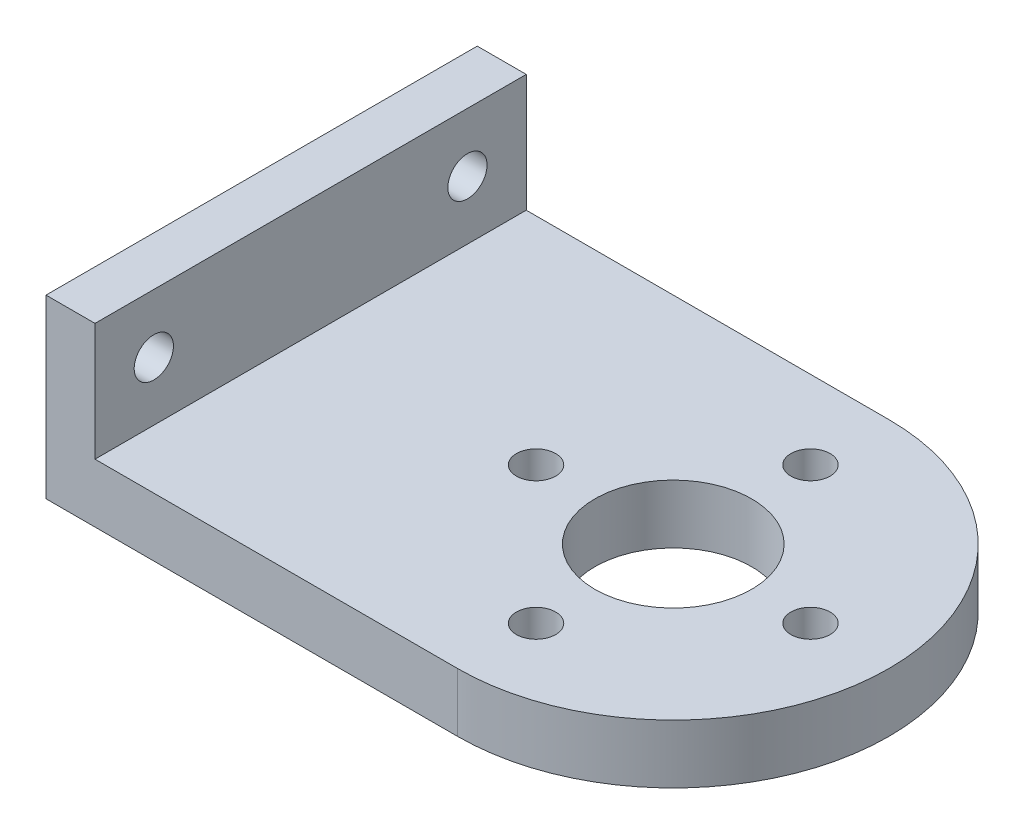
ISO-10303-21;
HEADER;
FILE_DESCRIPTION(('STEP AP214'),'2;1');
FILE_NAME('part.step','',(''),(''),'','','');
FILE_SCHEMA(('AUTOMOTIVE_DESIGN { 1 0 10303 214 1 1 1 1 }'));
ENDSEC;
DATA;
#1=APPLICATION_CONTEXT('core data for automotive mechanical design processes');
#2=APPLICATION_PROTOCOL_DEFINITION('international standard','automotive_design',2000,#1);
#3=PRODUCT_CONTEXT('',#1,'mechanical');
#4=PRODUCT('Part','Part','',(#3));
#5=PRODUCT_RELATED_PRODUCT_CATEGORY('part','',(#4));
#6=PRODUCT_DEFINITION_FORMATION('','',#4);
#7=PRODUCT_DEFINITION_CONTEXT('part definition',#1,'design');
#8=PRODUCT_DEFINITION('design','',#6,#7);
#9=PRODUCT_DEFINITION_SHAPE('','',#8);
#10=(LENGTH_UNIT() NAMED_UNIT(*) SI_UNIT(.MILLI.,.METRE.));
#11=(NAMED_UNIT(*) PLANE_ANGLE_UNIT() SI_UNIT($,.RADIAN.));
#12=(NAMED_UNIT(*) SI_UNIT($,.STERADIAN.) SOLID_ANGLE_UNIT());
#13=UNCERTAINTY_MEASURE_WITH_UNIT(LENGTH_MEASURE(1.E-05),#10,'distance_accuracy_value','');
#14=(GEOMETRIC_REPRESENTATION_CONTEXT(3) GLOBAL_UNCERTAINTY_ASSIGNED_CONTEXT((#13)) GLOBAL_UNIT_ASSIGNED_CONTEXT((#10,
#11,#12)) REPRESENTATION_CONTEXT('',''));
#15=CARTESIAN_POINT('',(0.,0.,0.));
#16=DIRECTION('',(0.,0.,1.));
#17=DIRECTION('',(1.,0.,0.));
#18=AXIS2_PLACEMENT_3D('',#15,#16,#17);
#19=CARTESIAN_POINT('',(-14.,3.,0.));
#20=DIRECTION('',(-1.,0.,0.));
#21=DIRECTION('',(0.,0.,1.));
#22=AXIS2_PLACEMENT_3D('',#19,#20,#21);
#23=PLANE('',#22);
#24=CARTESIAN_POINT('',(-14.,6.,8.));
#25=DIRECTION('',(-1.,0.,0.));
#26=DIRECTION('',(0.,0.,1.));
#27=AXIS2_PLACEMENT_3D('',#24,#25,#26);
#28=CIRCLE('',#27,1.);
#29=CARTESIAN_POINT('',(-14.,6.,9.));
#30=VERTEX_POINT('',#29);
#31=EDGE_CURVE('E169',#30,#30,#28,.T.);
#32=ORIENTED_EDGE('',*,*,#31,.F.);
#33=EDGE_LOOP('',(#32));
#34=FACE_BOUND('',#33,.T.);
#35=CARTESIAN_POINT('',(-14.,6.,-8.));
#36=DIRECTION('',(-1.,0.,0.));
#37=DIRECTION('',(0.,0.,1.));
#38=AXIS2_PLACEMENT_3D('',#35,#36,#37);
#39=CIRCLE('',#38,1.);
#40=CARTESIAN_POINT('',(-14.,6.,-7.));
#41=VERTEX_POINT('',#40);
#42=EDGE_CURVE('E155',#41,#41,#39,.T.);
#43=ORIENTED_EDGE('',*,*,#42,.F.);
#44=EDGE_LOOP('',(#43));
#45=FACE_BOUND('',#44,.T.);
#46=DIRECTION('',(0.,0.,-1.));
#47=VECTOR('',#46,1.);
#48=CARTESIAN_POINT('',(-14.,0.,0.));
#49=LINE('',#48,#47);
#50=CARTESIAN_POINT('',(-14.,0.,11.));
#51=VERTEX_POINT('',#50);
#52=CARTESIAN_POINT('',(-14.,0.,-11.));
#53=VERTEX_POINT('',#52);
#54=EDGE_CURVE('E80',#51,#53,#49,.T.);
#55=ORIENTED_EDGE('',*,*,#54,.F.);
#56=DIRECTION('',(0.,-1.,0.));
#57=VECTOR('',#56,1.);
#58=CARTESIAN_POINT('',(-14.,3.,11.));
#59=LINE('',#58,#57);
#60=CARTESIAN_POINT('',(-14.,9.,11.));
#61=VERTEX_POINT('',#60);
#62=EDGE_CURVE('E11',#61,#51,#59,.T.);
#63=ORIENTED_EDGE('',*,*,#62,.F.);
#64=DIRECTION('',(0.,0.,1.));
#65=VECTOR('',#64,1.);
#66=CARTESIAN_POINT('',(-14.,9.,11.));
#67=LINE('',#66,#65);
#68=CARTESIAN_POINT('',(-14.,9.,-11.));
#69=VERTEX_POINT('',#68);
#70=EDGE_CURVE('E83',#69,#61,#67,.T.);
#71=ORIENTED_EDGE('',*,*,#70,.F.);
#72=DIRECTION('',(0.,-1.,0.));
#73=VECTOR('',#72,1.);
#74=CARTESIAN_POINT('',(-14.,3.,-11.));
#75=LINE('',#74,#73);
#76=EDGE_CURVE('E77',#69,#53,#75,.T.);
#77=ORIENTED_EDGE('',*,*,#76,.T.);
#78=EDGE_LOOP('',(#55,#63,#71,#77));
#79=FACE_BOUND('',#78,.T.);
#80=ADVANCED_FACE('F35',(#34,#45,#79),#23,.T.);
#81=CARTESIAN_POINT('',(0.,3.,11.));
#82=DIRECTION('',(0.,0.,1.));
#83=DIRECTION('',(1.,0.,0.));
#84=AXIS2_PLACEMENT_3D('',#81,#82,#83);
#85=PLANE('',#84);
#86=DIRECTION('',(-1.,0.,0.));
#87=VECTOR('',#86,1.);
#88=CARTESIAN_POINT('',(0.,0.,11.));
#89=LINE('',#88,#87);
#90=CARTESIAN_POINT('',(7.,0.,11.));
#91=VERTEX_POINT('',#90);
#92=EDGE_CURVE('E97',#91,#51,#89,.T.);
#93=ORIENTED_EDGE('',*,*,#92,.F.);
#94=DIRECTION('',(0.,-1.,0.));
#95=VECTOR('',#94,1.);
#96=CARTESIAN_POINT('',(7.,3.,11.));
#97=LINE('',#96,#95);
#98=CARTESIAN_POINT('',(7.,3.,11.));
#99=VERTEX_POINT('',#98);
#100=EDGE_CURVE('E43',#99,#91,#97,.T.);
#101=ORIENTED_EDGE('',*,*,#100,.F.);
#102=DIRECTION('',(-1.,0.,0.));
#103=VECTOR('',#102,1.);
#104=CARTESIAN_POINT('',(0.,3.,11.));
#105=LINE('',#104,#103);
#106=CARTESIAN_POINT('',(-11.5,3.,11.));
#107=VERTEX_POINT('',#106);
#108=EDGE_CURVE('E136',#99,#107,#105,.T.);
#109=ORIENTED_EDGE('',*,*,#108,.T.);
#110=DIRECTION('',(0.,-1.,0.));
#111=VECTOR('',#110,1.);
#112=CARTESIAN_POINT('',(-11.5,9.,11.));
#113=LINE('',#112,#111);
#114=CARTESIAN_POINT('',(-11.5,9.,11.));
#115=VERTEX_POINT('',#114);
#116=EDGE_CURVE('E131',#115,#107,#113,.T.);
#117=ORIENTED_EDGE('',*,*,#116,.F.);
#118=DIRECTION('',(1.,0.,0.));
#119=VECTOR('',#118,1.);
#120=CARTESIAN_POINT('',(-11.5,9.,11.));
#121=LINE('',#120,#119);
#122=EDGE_CURVE('E160',#61,#115,#121,.T.);
#123=ORIENTED_EDGE('',*,*,#122,.F.);
#124=ORIENTED_EDGE('',*,*,#62,.T.);
#125=EDGE_LOOP('',(#93,#101,#109,#117,#123,#124));
#126=FACE_BOUND('',#125,.T.);
#127=ADVANCED_FACE('F117',(#126),#85,.T.);
#128=CARTESIAN_POINT('',(7.,3.,0.));
#129=DIRECTION('',(0.,-1.,0.));
#130=DIRECTION('',(0.,0.,-1.));
#131=AXIS2_PLACEMENT_3D('',#128,#129,#130);
#132=CYLINDRICAL_SURFACE('',#131,11.);
#133=CARTESIAN_POINT('',(7.,0.,0.));
#134=DIRECTION('',(0.,1.,0.));
#135=DIRECTION('',(0.,0.,1.));
#136=AXIS2_PLACEMENT_3D('',#133,#134,#135);
#137=CIRCLE('',#136,11.);
#138=CARTESIAN_POINT('',(7.,0.,-11.));
#139=VERTEX_POINT('',#138);
#140=EDGE_CURVE('E104',#91,#139,#137,.T.);
#141=ORIENTED_EDGE('',*,*,#140,.T.);
#142=DIRECTION('',(0.,-1.,0.));
#143=VECTOR('',#142,1.);
#144=CARTESIAN_POINT('',(7.,3.,-11.));
#145=LINE('',#144,#143);
#146=CARTESIAN_POINT('',(7.,3.,-11.));
#147=VERTEX_POINT('',#146);
#148=EDGE_CURVE('E87',#147,#139,#145,.T.);
#149=ORIENTED_EDGE('',*,*,#148,.F.);
#150=CARTESIAN_POINT('',(7.,3.,0.));
#151=DIRECTION('',(0.,1.,0.));
#152=DIRECTION('',(0.,0.,1.));
#153=AXIS2_PLACEMENT_3D('',#150,#151,#152);
#154=CIRCLE('',#153,11.);
#155=EDGE_CURVE('E115',#99,#147,#154,.T.);
#156=ORIENTED_EDGE('',*,*,#155,.F.);
#157=ORIENTED_EDGE('',*,*,#100,.T.);
#158=EDGE_LOOP('',(#141,#149,#156,#157));
#159=FACE_BOUND('',#158,.T.);
#160=ADVANCED_FACE('F114',(#159),#132,.T.);
#161=CARTESIAN_POINT('',(0.,3.,-11.));
#162=DIRECTION('',(0.,0.,-1.));
#163=DIRECTION('',(-1.,0.,0.));
#164=AXIS2_PLACEMENT_3D('',#161,#162,#163);
#165=PLANE('',#164);
#166=DIRECTION('',(1.,0.,0.));
#167=VECTOR('',#166,1.);
#168=CARTESIAN_POINT('',(0.,0.,-11.));
#169=LINE('',#168,#167);
#170=EDGE_CURVE('E95',#53,#139,#169,.T.);
#171=ORIENTED_EDGE('',*,*,#170,.F.);
#172=ORIENTED_EDGE('',*,*,#76,.F.);
#173=DIRECTION('',(-1.,0.,0.));
#174=VECTOR('',#173,1.);
#175=CARTESIAN_POINT('',(-14.,9.,-11.));
#176=LINE('',#175,#174);
#177=CARTESIAN_POINT('',(-11.5,9.,-11.));
#178=VERTEX_POINT('',#177);
#179=EDGE_CURVE('E153',#178,#69,#176,.T.);
#180=ORIENTED_EDGE('',*,*,#179,.F.);
#181=DIRECTION('',(0.,-1.,0.));
#182=VECTOR('',#181,1.);
#183=CARTESIAN_POINT('',(-11.5,9.,-11.));
#184=LINE('',#183,#182);
#185=CARTESIAN_POINT('',(-11.5,3.,-11.));
#186=VERTEX_POINT('',#185);
#187=EDGE_CURVE('E151',#178,#186,#184,.T.);
#188=ORIENTED_EDGE('',*,*,#187,.T.);
#189=DIRECTION('',(1.,0.,0.));
#190=VECTOR('',#189,1.);
#191=CARTESIAN_POINT('',(0.,3.,-11.));
#192=LINE('',#191,#190);
#193=EDGE_CURVE('E58',#186,#147,#192,.T.);
#194=ORIENTED_EDGE('',*,*,#193,.T.);
#195=ORIENTED_EDGE('',*,*,#148,.T.);
#196=EDGE_LOOP('',(#171,#172,#180,#188,#194,#195));
#197=FACE_BOUND('',#196,.T.);
#198=ADVANCED_FACE('F100',(#197),#165,.T.);
#199=CARTESIAN_POINT('',(7.00000000000007,3.,-7.));
#200=DIRECTION('',(0.,-1.,0.));
#201=DIRECTION('',(0.,0.,-1.));
#202=AXIS2_PLACEMENT_3D('',#199,#200,#201);
#203=CYLINDRICAL_SURFACE('',#202,1.);
#204=CARTESIAN_POINT('',(7.00000000000007,3.,-7.));
#205=DIRECTION('',(0.,1.,0.));
#206=DIRECTION('',(0.,0.,1.));
#207=AXIS2_PLACEMENT_3D('',#204,#205,#206);
#208=CIRCLE('',#207,1.);
#209=CARTESIAN_POINT('',(7.00000000000007,3.,-6.));
#210=VERTEX_POINT('',#209);
#211=EDGE_CURVE('E138',#210,#210,#208,.T.);
#212=ORIENTED_EDGE('',*,*,#211,.T.);
#213=EDGE_LOOP('',(#212));
#214=FACE_BOUND('',#213,.T.);
#215=CARTESIAN_POINT('',(7.00000000000007,0.,-7.));
#216=DIRECTION('',(0.,1.,0.));
#217=DIRECTION('',(0.,0.,1.));
#218=AXIS2_PLACEMENT_3D('',#215,#216,#217);
#219=CIRCLE('',#218,1.);
#220=CARTESIAN_POINT('',(7.00000000000007,0.,-6.));
#221=VERTEX_POINT('',#220);
#222=EDGE_CURVE('E98',#221,#221,#219,.T.);
#223=ORIENTED_EDGE('',*,*,#222,.F.);
#224=EDGE_LOOP('',(#223));
#225=FACE_BOUND('',#224,.T.);
#226=ADVANCED_FACE('F233',(#214,#225),#203,.F.);
#227=CARTESIAN_POINT('',(14.,3.,0.));
#228=DIRECTION('',(0.,-1.,0.));
#229=DIRECTION('',(0.,0.,-1.));
#230=AXIS2_PLACEMENT_3D('',#227,#228,#229);
#231=CYLINDRICAL_SURFACE('',#230,1.);
#232=CARTESIAN_POINT('',(14.,3.,0.));
#233=DIRECTION('',(0.,1.,0.));
#234=DIRECTION('',(0.,0.,1.));
#235=AXIS2_PLACEMENT_3D('',#232,#233,#234);
#236=CIRCLE('',#235,1.);
#237=CARTESIAN_POINT('',(14.,3.,1.));
#238=VERTEX_POINT('',#237);
#239=EDGE_CURVE('E141',#238,#238,#236,.T.);
#240=ORIENTED_EDGE('',*,*,#239,.T.);
#241=EDGE_LOOP('',(#240));
#242=FACE_BOUND('',#241,.T.);
#243=CARTESIAN_POINT('',(14.,0.,0.));
#244=DIRECTION('',(0.,1.,0.));
#245=DIRECTION('',(0.,0.,1.));
#246=AXIS2_PLACEMENT_3D('',#243,#244,#245);
#247=CIRCLE('',#246,1.);
#248=CARTESIAN_POINT('',(14.,0.,1.));
#249=VERTEX_POINT('',#248);
#250=EDGE_CURVE('E122',#249,#249,#247,.T.);
#251=ORIENTED_EDGE('',*,*,#250,.F.);
#252=EDGE_LOOP('',(#251));
#253=FACE_BOUND('',#252,.T.);
#254=ADVANCED_FACE('F236',(#242,#253),#231,.F.);
#255=CARTESIAN_POINT('',(7.,3.,0.));
#256=DIRECTION('',(0.,-1.,0.));
#257=DIRECTION('',(0.,0.,-1.));
#258=AXIS2_PLACEMENT_3D('',#255,#256,#257);
#259=CYLINDRICAL_SURFACE('',#258,4.);
#260=CARTESIAN_POINT('',(7.,3.,0.));
#261=DIRECTION('',(0.,1.,0.));
#262=DIRECTION('',(0.,0.,1.));
#263=AXIS2_PLACEMENT_3D('',#260,#261,#262);
#264=CIRCLE('',#263,4.);
#265=CARTESIAN_POINT('',(7.,3.,4.));
#266=VERTEX_POINT('',#265);
#267=EDGE_CURVE('E144',#266,#266,#264,.T.);
#268=ORIENTED_EDGE('',*,*,#267,.T.);
#269=EDGE_LOOP('',(#268));
#270=FACE_BOUND('',#269,.T.);
#271=CARTESIAN_POINT('',(7.,0.,0.));
#272=DIRECTION('',(0.,1.,0.));
#273=DIRECTION('',(0.,0.,1.));
#274=AXIS2_PLACEMENT_3D('',#271,#272,#273);
#275=CIRCLE('',#274,4.);
#276=CARTESIAN_POINT('',(7.,0.,4.));
#277=VERTEX_POINT('',#276);
#278=EDGE_CURVE('E125',#277,#277,#275,.T.);
#279=ORIENTED_EDGE('',*,*,#278,.F.);
#280=EDGE_LOOP('',(#279));
#281=FACE_BOUND('',#280,.T.);
#282=ADVANCED_FACE('F239',(#270,#281),#259,.F.);
#283=CARTESIAN_POINT('',(0.,3.,0.));
#284=DIRECTION('',(0.,-1.,0.));
#285=DIRECTION('',(0.,0.,-1.));
#286=AXIS2_PLACEMENT_3D('',#283,#284,#285);
#287=CYLINDRICAL_SURFACE('',#286,1.);
#288=CARTESIAN_POINT('',(0.,3.,0.));
#289=DIRECTION('',(0.,1.,0.));
#290=DIRECTION('',(0.,0.,1.));
#291=AXIS2_PLACEMENT_3D('',#288,#289,#290);
#292=CIRCLE('',#291,1.);
#293=CARTESIAN_POINT('',(0.,3.,1.00000000000005));
#294=VERTEX_POINT('',#293);
#295=EDGE_CURVE('E107',#294,#294,#292,.T.);
#296=ORIENTED_EDGE('',*,*,#295,.T.);
#297=EDGE_LOOP('',(#296));
#298=FACE_BOUND('',#297,.T.);
#299=CARTESIAN_POINT('',(0.,0.,0.));
#300=DIRECTION('',(0.,1.,0.));
#301=DIRECTION('',(0.,0.,1.));
#302=AXIS2_PLACEMENT_3D('',#299,#300,#301);
#303=CIRCLE('',#302,1.);
#304=CARTESIAN_POINT('',(0.,0.,1.00000000000005));
#305=VERTEX_POINT('',#304);
#306=EDGE_CURVE('E128',#305,#305,#303,.T.);
#307=ORIENTED_EDGE('',*,*,#306,.F.);
#308=EDGE_LOOP('',(#307));
#309=FACE_BOUND('',#308,.T.);
#310=ADVANCED_FACE('F37',(#298,#309),#287,.F.);
#311=CARTESIAN_POINT('',(6.99999999999998,3.,7.));
#312=DIRECTION('',(0.,-1.,0.));
#313=DIRECTION('',(0.,0.,-1.));
#314=AXIS2_PLACEMENT_3D('',#311,#312,#313);
#315=CYLINDRICAL_SURFACE('',#314,1.);
#316=CARTESIAN_POINT('',(6.99999999999998,3.,7.));
#317=DIRECTION('',(0.,1.,0.));
#318=DIRECTION('',(0.,0.,1.));
#319=AXIS2_PLACEMENT_3D('',#316,#317,#318);
#320=CIRCLE('',#319,1.);
#321=CARTESIAN_POINT('',(6.99999999999998,3.,8.));
#322=VERTEX_POINT('',#321);
#323=EDGE_CURVE('E88',#322,#322,#320,.T.);
#324=ORIENTED_EDGE('',*,*,#323,.T.);
#325=EDGE_LOOP('',(#324));
#326=FACE_BOUND('',#325,.T.);
#327=CARTESIAN_POINT('',(6.99999999999998,0.,7.));
#328=DIRECTION('',(0.,1.,0.));
#329=DIRECTION('',(0.,0.,1.));
#330=AXIS2_PLACEMENT_3D('',#327,#328,#329);
#331=CIRCLE('',#330,1.);
#332=CARTESIAN_POINT('',(6.99999999999998,0.,8.));
#333=VERTEX_POINT('',#332);
#334=EDGE_CURVE('E103',#333,#333,#331,.T.);
#335=ORIENTED_EDGE('',*,*,#334,.F.);
#336=EDGE_LOOP('',(#335));
#337=FACE_BOUND('',#336,.T.);
#338=ADVANCED_FACE('F200',(#326,#337),#315,.F.);
#339=CARTESIAN_POINT('',(0.,3.,0.));
#340=DIRECTION('',(0.,1.,0.));
#341=DIRECTION('',(0.,0.,1.));
#342=AXIS2_PLACEMENT_3D('',#339,#340,#341);
#343=PLANE('',#342);
#344=DIRECTION('',(0.,0.,-1.));
#345=VECTOR('',#344,1.);
#346=CARTESIAN_POINT('',(-11.5,3.,-11.));
#347=LINE('',#346,#345);
#348=EDGE_CURVE('E50',#107,#186,#347,.T.);
#349=ORIENTED_EDGE('',*,*,#348,.F.);
#350=ORIENTED_EDGE('',*,*,#108,.F.);
#351=ORIENTED_EDGE('',*,*,#155,.T.);
#352=ORIENTED_EDGE('',*,*,#193,.F.);
#353=EDGE_LOOP('',(#349,#350,#351,#352));
#354=FACE_BOUND('',#353,.T.);
#355=ORIENTED_EDGE('',*,*,#295,.F.);
#356=EDGE_LOOP('',(#355));
#357=FACE_BOUND('',#356,.T.);
#358=ORIENTED_EDGE('',*,*,#267,.F.);
#359=EDGE_LOOP('',(#358));
#360=FACE_BOUND('',#359,.T.);
#361=ORIENTED_EDGE('',*,*,#239,.F.);
#362=EDGE_LOOP('',(#361));
#363=FACE_BOUND('',#362,.T.);
#364=ORIENTED_EDGE('',*,*,#211,.F.);
#365=EDGE_LOOP('',(#364));
#366=FACE_BOUND('',#365,.T.);
#367=ORIENTED_EDGE('',*,*,#323,.F.);
#368=EDGE_LOOP('',(#367));
#369=FACE_BOUND('',#368,.T.);
#370=ADVANCED_FACE('F197',(#354,#357,#360,#363,#366,#369),#343,.T.);
#371=CARTESIAN_POINT('',(0.,0.,0.));
#372=DIRECTION('',(0.,1.,0.));
#373=DIRECTION('',(0.,0.,1.));
#374=AXIS2_PLACEMENT_3D('',#371,#372,#373);
#375=PLANE('',#374);
#376=ORIENTED_EDGE('',*,*,#306,.T.);
#377=EDGE_LOOP('',(#376));
#378=FACE_BOUND('',#377,.T.);
#379=ORIENTED_EDGE('',*,*,#278,.T.);
#380=EDGE_LOOP('',(#379));
#381=FACE_BOUND('',#380,.T.);
#382=ORIENTED_EDGE('',*,*,#250,.T.);
#383=EDGE_LOOP('',(#382));
#384=FACE_BOUND('',#383,.T.);
#385=ORIENTED_EDGE('',*,*,#222,.T.);
#386=EDGE_LOOP('',(#385));
#387=FACE_BOUND('',#386,.T.);
#388=ORIENTED_EDGE('',*,*,#54,.T.);
#389=ORIENTED_EDGE('',*,*,#170,.T.);
#390=ORIENTED_EDGE('',*,*,#140,.F.);
#391=ORIENTED_EDGE('',*,*,#92,.T.);
#392=EDGE_LOOP('',(#388,#389,#390,#391));
#393=FACE_BOUND('',#392,.T.);
#394=ORIENTED_EDGE('',*,*,#334,.T.);
#395=EDGE_LOOP('',(#394));
#396=FACE_BOUND('',#395,.T.);
#397=ADVANCED_FACE('F92',(#378,#381,#384,#387,#393,#396),#375,.F.);
#398=CARTESIAN_POINT('',(-11.5,9.,-11.));
#399=DIRECTION('',(-1.,0.,0.));
#400=DIRECTION('',(0.,0.,1.));
#401=AXIS2_PLACEMENT_3D('',#398,#399,#400);
#402=PLANE('',#401);
#403=CARTESIAN_POINT('',(-11.5,6.,8.));
#404=DIRECTION('',(1.,0.,0.));
#405=DIRECTION('',(0.,0.,-1.));
#406=AXIS2_PLACEMENT_3D('',#403,#404,#405);
#407=CIRCLE('',#406,1.);
#408=CARTESIAN_POINT('',(-11.5,6.,7.));
#409=VERTEX_POINT('',#408);
#410=EDGE_CURVE('E172',#409,#409,#407,.T.);
#411=ORIENTED_EDGE('',*,*,#410,.F.);
#412=EDGE_LOOP('',(#411));
#413=FACE_BOUND('',#412,.T.);
#414=CARTESIAN_POINT('',(-11.5,6.,-8.));
#415=DIRECTION('',(1.,0.,0.));
#416=DIRECTION('',(0.,0.,-1.));
#417=AXIS2_PLACEMENT_3D('',#414,#415,#416);
#418=CIRCLE('',#417,1.);
#419=CARTESIAN_POINT('',(-11.5,6.,-9.));
#420=VERTEX_POINT('',#419);
#421=EDGE_CURVE('E166',#420,#420,#418,.T.);
#422=ORIENTED_EDGE('',*,*,#421,.F.);
#423=EDGE_LOOP('',(#422));
#424=FACE_BOUND('',#423,.T.);
#425=ORIENTED_EDGE('',*,*,#348,.T.);
#426=ORIENTED_EDGE('',*,*,#187,.F.);
#427=DIRECTION('',(0.,0.,-1.));
#428=VECTOR('',#427,1.);
#429=CARTESIAN_POINT('',(-11.5,9.,-11.));
#430=LINE('',#429,#428);
#431=EDGE_CURVE('E157',#115,#178,#430,.T.);
#432=ORIENTED_EDGE('',*,*,#431,.F.);
#433=ORIENTED_EDGE('',*,*,#116,.T.);
#434=EDGE_LOOP('',(#425,#426,#432,#433));
#435=FACE_BOUND('',#434,.T.);
#436=ADVANCED_FACE('F178',(#413,#424,#435),#402,.F.);
#437=CARTESIAN_POINT('',(0.,9.,0.));
#438=DIRECTION('',(0.,-1.,0.));
#439=DIRECTION('',(0.,0.,-1.));
#440=AXIS2_PLACEMENT_3D('',#437,#438,#439);
#441=PLANE('',#440);
#442=ORIENTED_EDGE('',*,*,#70,.T.);
#443=ORIENTED_EDGE('',*,*,#122,.T.);
#444=ORIENTED_EDGE('',*,*,#431,.T.);
#445=ORIENTED_EDGE('',*,*,#179,.T.);
#446=EDGE_LOOP('',(#442,#443,#444,#445));
#447=FACE_BOUND('',#446,.T.);
#448=ADVANCED_FACE('F181',(#447),#441,.F.);
#449=CARTESIAN_POINT('',(-17.5,6.,-8.));
#450=DIRECTION('',(1.,0.,0.));
#451=DIRECTION('',(0.,0.,-1.));
#452=AXIS2_PLACEMENT_3D('',#449,#450,#451);
#453=CYLINDRICAL_SURFACE('',#452,1.);
#454=ORIENTED_EDGE('',*,*,#42,.T.);
#455=EDGE_LOOP('',(#454));
#456=FACE_BOUND('',#455,.T.);
#457=ORIENTED_EDGE('',*,*,#421,.T.);
#458=EDGE_LOOP('',(#457));
#459=FACE_BOUND('',#458,.T.);
#460=ADVANCED_FACE('F282',(#456,#459),#453,.F.);
#461=CARTESIAN_POINT('',(-17.5,6.,8.));
#462=DIRECTION('',(1.,0.,0.));
#463=DIRECTION('',(0.,0.,-1.));
#464=AXIS2_PLACEMENT_3D('',#461,#462,#463);
#465=CYLINDRICAL_SURFACE('',#464,1.);
#466=ORIENTED_EDGE('',*,*,#31,.T.);
#467=EDGE_LOOP('',(#466));
#468=FACE_BOUND('',#467,.T.);
#469=ORIENTED_EDGE('',*,*,#410,.T.);
#470=EDGE_LOOP('',(#469));
#471=FACE_BOUND('',#470,.T.);
#472=ADVANCED_FACE('F176',(#468,#471),#465,.F.);
#473=CLOSED_SHELL('',(#80,#127,#160,#198,#226,#254,#282,#310,#338,#370,#397,#436,#448,#460,#472));
#474=MANIFOLD_SOLID_BREP('B2',#473);
#475=ADVANCED_BREP_SHAPE_REPRESENTATION('',(#18,#474),#14);
#476=SHAPE_DEFINITION_REPRESENTATION(#9,#475);
ENDSEC;
END-ISO-10303-21;
